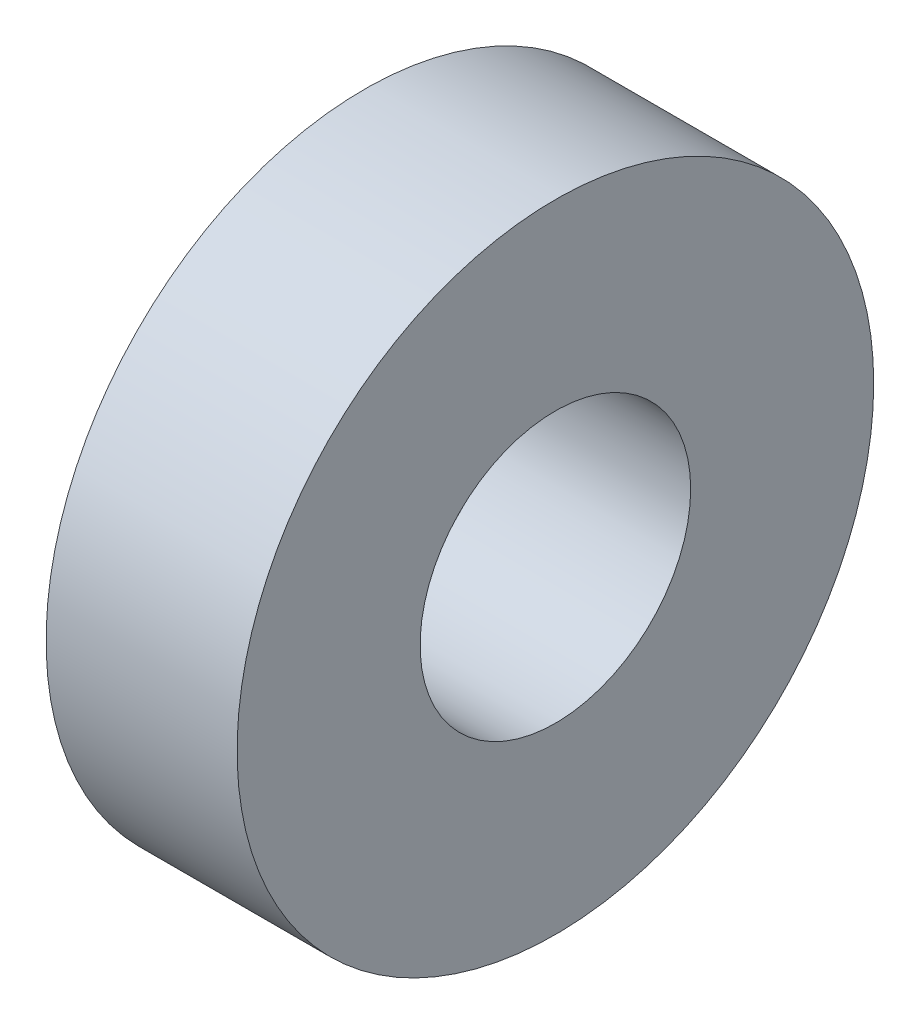
ISO-10303-21;
HEADER;
FILE_DESCRIPTION(('STEP AP214'),'2;1');
FILE_NAME('part.step','',(''),(''),'','','');
FILE_SCHEMA(('AUTOMOTIVE_DESIGN { 1 0 10303 214 1 1 1 1 }'));
ENDSEC;
DATA;
#1=APPLICATION_CONTEXT('core data for automotive mechanical design processes');
#2=APPLICATION_PROTOCOL_DEFINITION('international standard','automotive_design',2000,#1);
#3=PRODUCT_CONTEXT('',#1,'mechanical');
#4=PRODUCT('Part','Part','',(#3));
#5=PRODUCT_RELATED_PRODUCT_CATEGORY('part','',(#4));
#6=PRODUCT_DEFINITION_FORMATION('','',#4);
#7=PRODUCT_DEFINITION_CONTEXT('part definition',#1,'design');
#8=PRODUCT_DEFINITION('design','',#6,#7);
#9=PRODUCT_DEFINITION_SHAPE('','',#8);
#10=(LENGTH_UNIT() NAMED_UNIT(*) SI_UNIT(.MILLI.,.METRE.));
#11=(NAMED_UNIT(*) PLANE_ANGLE_UNIT() SI_UNIT($,.RADIAN.));
#12=(NAMED_UNIT(*) SI_UNIT($,.STERADIAN.) SOLID_ANGLE_UNIT());
#13=UNCERTAINTY_MEASURE_WITH_UNIT(LENGTH_MEASURE(1.E-05),#10,'distance_accuracy_value','');
#14=(GEOMETRIC_REPRESENTATION_CONTEXT(3) GLOBAL_UNCERTAINTY_ASSIGNED_CONTEXT((#13)) GLOBAL_UNIT_ASSIGNED_CONTEXT((#10,
#11,#12)) REPRESENTATION_CONTEXT('',''));
#15=CARTESIAN_POINT('',(0.,0.,0.));
#16=DIRECTION('',(0.,0.,1.));
#17=DIRECTION('',(1.,0.,0.));
#18=AXIS2_PLACEMENT_3D('',#15,#16,#17);
#19=CARTESIAN_POINT('',(6.,0.,0.));
#20=DIRECTION('',(1.,0.,0.));
#21=DIRECTION('',(0.,0.,-1.));
#22=AXIS2_PLACEMENT_3D('',#19,#20,#21);
#23=PLANE('',#22);
#24=CARTESIAN_POINT('',(6.,0.,0.));
#25=DIRECTION('',(1.,0.,0.));
#26=DIRECTION('',(0.,0.,-1.));
#27=AXIS2_PLACEMENT_3D('',#24,#25,#26);
#28=CIRCLE('',#27,20.);
#29=CARTESIAN_POINT('',(6.,0.,-20.));
#30=VERTEX_POINT('',#29);
#31=EDGE_CURVE('E10',#30,#30,#28,.T.);
#32=ORIENTED_EDGE('',*,*,#31,.T.);
#33=EDGE_LOOP('',(#32));
#34=FACE_BOUND('',#33,.T.);
#35=CARTESIAN_POINT('',(6.,0.,0.));
#36=DIRECTION('',(1.,0.,0.));
#37=DIRECTION('',(0.,0.,-1.));
#38=AXIS2_PLACEMENT_3D('',#35,#36,#37);
#39=CIRCLE('',#38,8.5);
#40=CARTESIAN_POINT('',(6.,0.,-8.5));
#41=VERTEX_POINT('',#40);
#42=EDGE_CURVE('E41',#41,#41,#39,.T.);
#43=ORIENTED_EDGE('',*,*,#42,.F.);
#44=EDGE_LOOP('',(#43));
#45=FACE_BOUND('',#44,.T.);
#46=ADVANCED_FACE('F30',(#34,#45),#23,.T.);
#47=CARTESIAN_POINT('',(-6.,0.,0.));
#48=DIRECTION('',(1.,0.,0.));
#49=DIRECTION('',(0.,0.,-1.));
#50=AXIS2_PLACEMENT_3D('',#47,#48,#49);
#51=PLANE('',#50);
#52=CARTESIAN_POINT('',(-6.,0.,0.));
#53=DIRECTION('',(1.,0.,0.));
#54=DIRECTION('',(0.,0.,-1.));
#55=AXIS2_PLACEMENT_3D('',#52,#53,#54);
#56=CIRCLE('',#55,20.);
#57=CARTESIAN_POINT('',(-6.,0.,-20.));
#58=VERTEX_POINT('',#57);
#59=EDGE_CURVE('E34',#58,#58,#56,.T.);
#60=ORIENTED_EDGE('',*,*,#59,.F.);
#61=EDGE_LOOP('',(#60));
#62=FACE_BOUND('',#61,.T.);
#63=CARTESIAN_POINT('',(-6.,0.,0.));
#64=DIRECTION('',(1.,0.,0.));
#65=DIRECTION('',(0.,0.,-1.));
#66=AXIS2_PLACEMENT_3D('',#63,#64,#65);
#67=CIRCLE('',#66,8.5);
#68=CARTESIAN_POINT('',(-6.,0.,-8.5));
#69=VERTEX_POINT('',#68);
#70=EDGE_CURVE('E43',#69,#69,#67,.T.);
#71=ORIENTED_EDGE('',*,*,#70,.T.);
#72=EDGE_LOOP('',(#71));
#73=FACE_BOUND('',#72,.T.);
#74=ADVANCED_FACE('F53',(#62,#73),#51,.F.);
#75=CARTESIAN_POINT('',(6.,0.,0.));
#76=DIRECTION('',(-1.,0.,0.));
#77=DIRECTION('',(0.,0.,1.));
#78=AXIS2_PLACEMENT_3D('',#75,#76,#77);
#79=CYLINDRICAL_SURFACE('',#78,20.);
#80=ORIENTED_EDGE('',*,*,#31,.F.);
#81=EDGE_LOOP('',(#80));
#82=FACE_BOUND('',#81,.T.);
#83=ORIENTED_EDGE('',*,*,#59,.T.);
#84=EDGE_LOOP('',(#83));
#85=FACE_BOUND('',#84,.T.);
#86=ADVANCED_FACE('F32',(#82,#85),#79,.T.);
#87=CARTESIAN_POINT('',(6.,0.,0.));
#88=DIRECTION('',(-1.,0.,0.));
#89=DIRECTION('',(0.,0.,1.));
#90=AXIS2_PLACEMENT_3D('',#87,#88,#89);
#91=CYLINDRICAL_SURFACE('',#90,8.5);
#92=ORIENTED_EDGE('',*,*,#42,.T.);
#93=EDGE_LOOP('',(#92));
#94=FACE_BOUND('',#93,.T.);
#95=ORIENTED_EDGE('',*,*,#70,.F.);
#96=EDGE_LOOP('',(#95));
#97=FACE_BOUND('',#96,.T.);
#98=ADVANCED_FACE('F49',(#94,#97),#91,.F.);
#99=CLOSED_SHELL('',(#46,#74,#86,#98));
#100=MANIFOLD_SOLID_BREP('B2',#99);
#101=ADVANCED_BREP_SHAPE_REPRESENTATION('',(#18,#100),#14);
#102=SHAPE_DEFINITION_REPRESENTATION(#9,#101);
ENDSEC;
END-ISO-10303-21;
